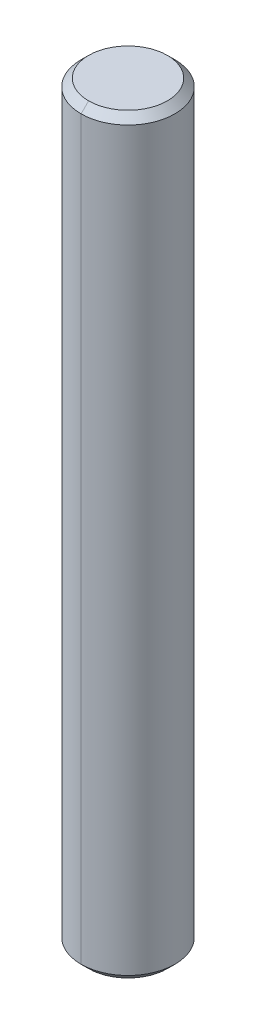
ISO-10303-21;
HEADER;
FILE_DESCRIPTION(('STEP AP214'),'2;1');
FILE_NAME('part.step','',(''),(''),'','','');
FILE_SCHEMA(('AUTOMOTIVE_DESIGN { 1 0 10303 214 1 1 1 1 }'));
ENDSEC;
DATA;
#1=APPLICATION_CONTEXT('core data for automotive mechanical design processes');
#2=APPLICATION_PROTOCOL_DEFINITION('international standard','automotive_design',2000,#1);
#3=PRODUCT_CONTEXT('',#1,'mechanical');
#4=PRODUCT('Part','Part','',(#3));
#5=PRODUCT_RELATED_PRODUCT_CATEGORY('part','',(#4));
#6=PRODUCT_DEFINITION_FORMATION('','',#4);
#7=PRODUCT_DEFINITION_CONTEXT('part definition',#1,'design');
#8=PRODUCT_DEFINITION('design','',#6,#7);
#9=PRODUCT_DEFINITION_SHAPE('','',#8);
#10=(LENGTH_UNIT() NAMED_UNIT(*) SI_UNIT(.MILLI.,.METRE.));
#11=(NAMED_UNIT(*) PLANE_ANGLE_UNIT() SI_UNIT($,.RADIAN.));
#12=(NAMED_UNIT(*) SI_UNIT($,.STERADIAN.) SOLID_ANGLE_UNIT());
#13=UNCERTAINTY_MEASURE_WITH_UNIT(LENGTH_MEASURE(1.E-05),#10,'distance_accuracy_value','');
#14=(GEOMETRIC_REPRESENTATION_CONTEXT(3) GLOBAL_UNCERTAINTY_ASSIGNED_CONTEXT((#13)) GLOBAL_UNIT_ASSIGNED_CONTEXT((#10,
#11,#12)) REPRESENTATION_CONTEXT('',''));
#15=CARTESIAN_POINT('',(0.,0.,0.));
#16=DIRECTION('',(0.,0.,1.));
#17=DIRECTION('',(1.,0.,0.));
#18=AXIS2_PLACEMENT_3D('',#15,#16,#17);
#19=CARTESIAN_POINT('',(0.,50.8,0.));
#20=DIRECTION('',(0.,-1.,0.));
#21=DIRECTION('',(0.,0.,-1.));
#22=AXIS2_PLACEMENT_3D('',#19,#20,#21);
#23=CONICAL_SURFACE('',#22,2.66319,0.785398163397444);
#24=DIRECTION('',(0.,-0.707106781186551,0.707106781186545));
#25=VECTOR('',#24,1.);
#26=CARTESIAN_POINT('',(0.,50.8,2.66319));
#27=LINE('',#26,#25);
#28=CARTESIAN_POINT('',(0.,50.8,2.66319));
#29=VERTEX_POINT('',#28);
#30=CARTESIAN_POINT('',(0.,50.292,3.17119));
#31=VERTEX_POINT('',#30);
#32=EDGE_CURVE('E79',#29,#31,#27,.T.);
#33=ORIENTED_EDGE('',*,*,#32,.F.);
#34=CARTESIAN_POINT('',(0.,50.8,0.));
#35=DIRECTION('',(0.,1.,0.));
#36=DIRECTION('',(0.,0.,1.));
#37=AXIS2_PLACEMENT_3D('',#34,#35,#36);
#38=CIRCLE('',#37,2.66319);
#39=CARTESIAN_POINT('',(0.,50.8,-2.66319));
#40=VERTEX_POINT('',#39);
#41=EDGE_CURVE('E27',#40,#29,#38,.T.);
#42=ORIENTED_EDGE('',*,*,#41,.F.);
#43=DIRECTION('',(0.,-0.707106781186551,-0.707106781186545));
#44=VECTOR('',#43,1.);
#45=CARTESIAN_POINT('',(0.,50.8,-2.66319));
#46=LINE('',#45,#44);
#47=CARTESIAN_POINT('',(0.,50.292,-3.17119));
#48=VERTEX_POINT('',#47);
#49=EDGE_CURVE('E87',#40,#48,#46,.T.);
#50=ORIENTED_EDGE('',*,*,#49,.T.);
#51=CARTESIAN_POINT('',(0.,50.292,0.));
#52=DIRECTION('',(0.,-1.,0.));
#53=DIRECTION('',(0.,0.,1.));
#54=AXIS2_PLACEMENT_3D('',#51,#52,#53);
#55=CIRCLE('',#54,3.17119);
#56=EDGE_CURVE('E80',#31,#48,#55,.T.);
#57=ORIENTED_EDGE('',*,*,#56,.F.);
#58=EDGE_LOOP('',(#33,#42,#50,#57));
#59=FACE_BOUND('',#58,.T.);
#60=ADVANCED_FACE('F16',(#59),#23,.T.);
#61=CARTESIAN_POINT('',(0.,0.508,0.));
#62=DIRECTION('',(0.,1.,0.));
#63=DIRECTION('',(0.,0.,1.));
#64=AXIS2_PLACEMENT_3D('',#61,#62,#63);
#65=CONICAL_SURFACE('',#64,3.17119,0.78539816339745);
#66=DIRECTION('',(0.,0.707106781186546,-0.707106781186549));
#67=VECTOR('',#66,1.);
#68=CARTESIAN_POINT('',(0.,0.508,-3.17119));
#69=LINE('',#68,#67);
#70=CARTESIAN_POINT('',(0.,0.,-2.66319));
#71=VERTEX_POINT('',#70);
#72=CARTESIAN_POINT('',(0.,0.508,-3.17119));
#73=VERTEX_POINT('',#72);
#74=EDGE_CURVE('E103',#71,#73,#69,.T.);
#75=ORIENTED_EDGE('',*,*,#74,.F.);
#76=CARTESIAN_POINT('',(0.,0.,0.));
#77=DIRECTION('',(0.,-1.,0.));
#78=DIRECTION('',(0.,0.,1.));
#79=AXIS2_PLACEMENT_3D('',#76,#77,#78);
#80=CIRCLE('',#79,2.66319);
#81=CARTESIAN_POINT('',(0.,0.,2.66319));
#82=VERTEX_POINT('',#81);
#83=EDGE_CURVE('E10',#82,#71,#80,.T.);
#84=ORIENTED_EDGE('',*,*,#83,.F.);
#85=DIRECTION('',(0.,0.707106781186546,0.707106781186549));
#86=VECTOR('',#85,1.);
#87=CARTESIAN_POINT('',(0.,0.508,3.17119));
#88=LINE('',#87,#86);
#89=CARTESIAN_POINT('',(0.,0.508,3.17119));
#90=VERTEX_POINT('',#89);
#91=EDGE_CURVE('E20',#82,#90,#88,.T.);
#92=ORIENTED_EDGE('',*,*,#91,.T.);
#93=CARTESIAN_POINT('',(0.,0.508,0.));
#94=DIRECTION('',(0.,1.,0.));
#95=DIRECTION('',(0.,0.,1.));
#96=AXIS2_PLACEMENT_3D('',#93,#94,#95);
#97=CIRCLE('',#96,3.17119);
#98=EDGE_CURVE('E41',#73,#90,#97,.T.);
#99=ORIENTED_EDGE('',*,*,#98,.F.);
#100=EDGE_LOOP('',(#75,#84,#92,#99));
#101=FACE_BOUND('',#100,.T.);
#102=ADVANCED_FACE('F139',(#101),#65,.T.);
#103=CARTESIAN_POINT('',(0.,0.,0.));
#104=DIRECTION('',(0.,1.,0.));
#105=DIRECTION('',(1.,0.,0.));
#106=AXIS2_PLACEMENT_3D('',#103,#104,#105);
#107=PLANE('',#106);
#108=ORIENTED_EDGE('',*,*,#83,.T.);
#109=CARTESIAN_POINT('',(0.,0.,0.));
#110=DIRECTION('',(0.,-1.,0.));
#111=DIRECTION('',(0.,0.,1.));
#112=AXIS2_PLACEMENT_3D('',#109,#110,#111);
#113=CIRCLE('',#112,2.66319);
#114=EDGE_CURVE('E99',#71,#82,#113,.T.);
#115=ORIENTED_EDGE('',*,*,#114,.T.);
#116=EDGE_LOOP('',(#108,#115));
#117=FACE_BOUND('',#116,.T.);
#118=ADVANCED_FACE('F134',(#117),#107,.F.);
#119=CARTESIAN_POINT('',(0.,50.8,0.));
#120=DIRECTION('',(0.,1.,0.));
#121=DIRECTION('',(1.,0.,0.));
#122=AXIS2_PLACEMENT_3D('',#119,#120,#121);
#123=PLANE('',#122);
#124=ORIENTED_EDGE('',*,*,#41,.T.);
#125=CARTESIAN_POINT('',(0.,50.8,0.));
#126=DIRECTION('',(0.,1.,0.));
#127=DIRECTION('',(0.,0.,1.));
#128=AXIS2_PLACEMENT_3D('',#125,#126,#127);
#129=CIRCLE('',#128,2.66319);
#130=EDGE_CURVE('E72',#29,#40,#129,.T.);
#131=ORIENTED_EDGE('',*,*,#130,.T.);
#132=EDGE_LOOP('',(#124,#131));
#133=FACE_BOUND('',#132,.T.);
#134=ADVANCED_FACE('F70',(#133),#123,.T.);
#135=CARTESIAN_POINT('',(0.,50.8,0.));
#136=DIRECTION('',(0.,-1.,0.));
#137=DIRECTION('',(0.,0.,-1.));
#138=AXIS2_PLACEMENT_3D('',#135,#136,#137);
#139=CYLINDRICAL_SURFACE('',#138,3.17119);
#140=DIRECTION('',(0.,-1.,0.));
#141=VECTOR('',#140,1.);
#142=CARTESIAN_POINT('',(0.,50.8,3.17119));
#143=LINE('',#142,#141);
#144=EDGE_CURVE('E96',#31,#90,#143,.T.);
#145=ORIENTED_EDGE('',*,*,#144,.F.);
#146=ORIENTED_EDGE('',*,*,#56,.T.);
#147=DIRECTION('',(0.,-1.,0.));
#148=VECTOR('',#147,1.);
#149=CARTESIAN_POINT('',(0.,50.8,-3.17119));
#150=LINE('',#149,#148);
#151=EDGE_CURVE('E93',#48,#73,#150,.T.);
#152=ORIENTED_EDGE('',*,*,#151,.T.);
#153=ORIENTED_EDGE('',*,*,#98,.T.);
#154=EDGE_LOOP('',(#145,#146,#152,#153));
#155=FACE_BOUND('',#154,.T.);
#156=ADVANCED_FACE('F125',(#155),#139,.T.);
#157=CARTESIAN_POINT('',(0.,50.8,0.));
#158=DIRECTION('',(0.,-1.,0.));
#159=DIRECTION('',(0.,0.,-1.));
#160=AXIS2_PLACEMENT_3D('',#157,#158,#159);
#161=CYLINDRICAL_SURFACE('',#160,3.17119);
#162=CARTESIAN_POINT('',(0.,50.292,0.));
#163=DIRECTION('',(0.,-1.,0.));
#164=DIRECTION('',(0.,0.,1.));
#165=AXIS2_PLACEMENT_3D('',#162,#163,#164);
#166=CIRCLE('',#165,3.17119);
#167=EDGE_CURVE('E84',#48,#31,#166,.T.);
#168=ORIENTED_EDGE('',*,*,#167,.T.);
#169=ORIENTED_EDGE('',*,*,#144,.T.);
#170=CARTESIAN_POINT('',(0.,0.508,0.));
#171=DIRECTION('',(0.,1.,0.));
#172=DIRECTION('',(0.,0.,1.));
#173=AXIS2_PLACEMENT_3D('',#170,#171,#172);
#174=CIRCLE('',#173,3.17119);
#175=EDGE_CURVE('E100',#90,#73,#174,.T.);
#176=ORIENTED_EDGE('',*,*,#175,.T.);
#177=ORIENTED_EDGE('',*,*,#151,.F.);
#178=EDGE_LOOP('',(#168,#169,#176,#177));
#179=FACE_BOUND('',#178,.T.);
#180=ADVANCED_FACE('F18',(#179),#161,.T.);
#181=CARTESIAN_POINT('',(0.,0.508,0.));
#182=DIRECTION('',(0.,1.,0.));
#183=DIRECTION('',(0.,0.,1.));
#184=AXIS2_PLACEMENT_3D('',#181,#182,#183);
#185=CONICAL_SURFACE('',#184,3.17119,0.78539816339745);
#186=ORIENTED_EDGE('',*,*,#114,.F.);
#187=ORIENTED_EDGE('',*,*,#74,.T.);
#188=ORIENTED_EDGE('',*,*,#175,.F.);
#189=ORIENTED_EDGE('',*,*,#91,.F.);
#190=EDGE_LOOP('',(#186,#187,#188,#189));
#191=FACE_BOUND('',#190,.T.);
#192=ADVANCED_FACE('F133',(#191),#185,.T.);
#193=CARTESIAN_POINT('',(0.,50.8,0.));
#194=DIRECTION('',(0.,-1.,0.));
#195=DIRECTION('',(0.,0.,-1.));
#196=AXIS2_PLACEMENT_3D('',#193,#194,#195);
#197=CONICAL_SURFACE('',#196,2.66319,0.785398163397444);
#198=ORIENTED_EDGE('',*,*,#130,.F.);
#199=ORIENTED_EDGE('',*,*,#32,.T.);
#200=ORIENTED_EDGE('',*,*,#167,.F.);
#201=ORIENTED_EDGE('',*,*,#49,.F.);
#202=EDGE_LOOP('',(#198,#199,#200,#201));
#203=FACE_BOUND('',#202,.T.);
#204=ADVANCED_FACE('F86',(#203),#197,.T.);
#205=CLOSED_SHELL('',(#60,#102,#118,#134,#156,#180,#192,#204));
#206=MANIFOLD_SOLID_BREP('B1',#205);
#207=ADVANCED_BREP_SHAPE_REPRESENTATION('',(#18,#206),#14);
#208=SHAPE_DEFINITION_REPRESENTATION(#9,#207);
ENDSEC;
END-ISO-10303-21;
